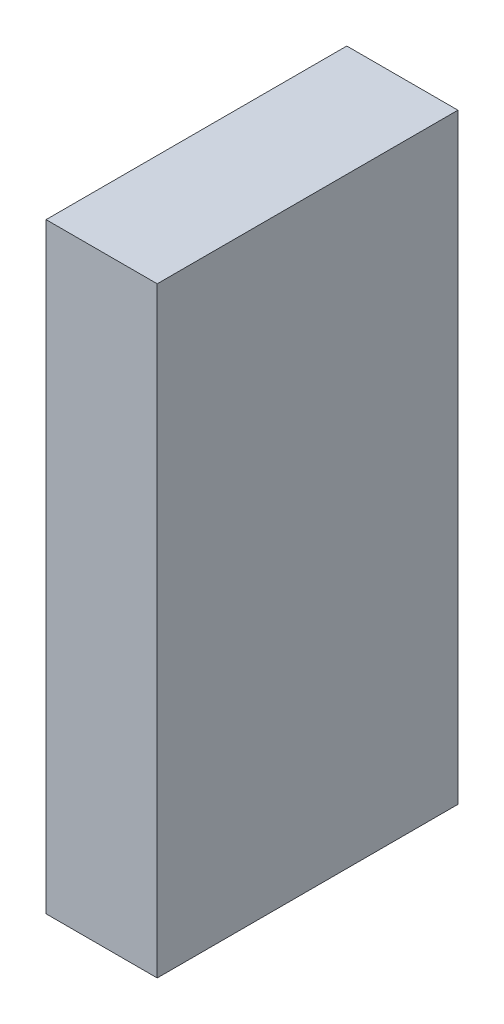
ISO-10303-21;
HEADER;
FILE_DESCRIPTION(('STEP AP214'),'2;1');
FILE_NAME('part.step','',(''),(''),'','','');
FILE_SCHEMA(('AUTOMOTIVE_DESIGN { 1 0 10303 214 1 1 1 1 }'));
ENDSEC;
DATA;
#1=APPLICATION_CONTEXT('core data for automotive mechanical design processes');
#2=APPLICATION_PROTOCOL_DEFINITION('international standard','automotive_design',2000,#1);
#3=PRODUCT_CONTEXT('',#1,'mechanical');
#4=PRODUCT('Part','Part','',(#3));
#5=PRODUCT_RELATED_PRODUCT_CATEGORY('part','',(#4));
#6=PRODUCT_DEFINITION_FORMATION('','',#4);
#7=PRODUCT_DEFINITION_CONTEXT('part definition',#1,'design');
#8=PRODUCT_DEFINITION('design','',#6,#7);
#9=PRODUCT_DEFINITION_SHAPE('','',#8);
#10=(LENGTH_UNIT() NAMED_UNIT(*) SI_UNIT(.MILLI.,.METRE.));
#11=(NAMED_UNIT(*) PLANE_ANGLE_UNIT() SI_UNIT($,.RADIAN.));
#12=(NAMED_UNIT(*) SI_UNIT($,.STERADIAN.) SOLID_ANGLE_UNIT());
#13=UNCERTAINTY_MEASURE_WITH_UNIT(LENGTH_MEASURE(1.E-05),#10,'distance_accuracy_value','');
#14=(GEOMETRIC_REPRESENTATION_CONTEXT(3) GLOBAL_UNCERTAINTY_ASSIGNED_CONTEXT((#13)) GLOBAL_UNIT_ASSIGNED_CONTEXT((#10,
#11,#12)) REPRESENTATION_CONTEXT('',''));
#15=CARTESIAN_POINT('',(0.,0.,0.));
#16=DIRECTION('',(0.,0.,1.));
#17=DIRECTION('',(1.,0.,0.));
#18=AXIS2_PLACEMENT_3D('',#15,#16,#17);
#19=CARTESIAN_POINT('',(0.2494915,1.34949184,0.));
#20=DIRECTION('',(1.,0.,0.));
#21=DIRECTION('',(0.,0.,-1.));
#22=AXIS2_PLACEMENT_3D('',#19,#20,#21);
#23=PLANE('',#22);
#24=DIRECTION('',(0.,0.,-1.));
#25=VECTOR('',#24,1.);
#26=CARTESIAN_POINT('',(0.2494915,-1.34949184,0.));
#27=LINE('',#26,#25);
#28=CARTESIAN_POINT('',(0.2494915,-1.34949184,0.));
#29=VERTEX_POINT('',#28);
#30=CARTESIAN_POINT('',(0.2494915,-1.34949184,1.34999984));
#31=VERTEX_POINT('',#30);
#32=EDGE_CURVE('E20',#29,#31,#27,.F.);
#33=ORIENTED_EDGE('',*,*,#32,.F.);
#34=DIRECTION('',(0.,1.,0.));
#35=VECTOR('',#34,1.);
#36=CARTESIAN_POINT('',(0.2494915,0.,0.));
#37=LINE('',#36,#35);
#38=CARTESIAN_POINT('',(0.2494915,1.34949184,0.));
#39=VERTEX_POINT('',#38);
#40=EDGE_CURVE('E80',#39,#29,#37,.F.);
#41=ORIENTED_EDGE('',*,*,#40,.F.);
#42=DIRECTION('',(0.,0.,1.));
#43=VECTOR('',#42,1.);
#44=CARTESIAN_POINT('',(0.2494915,1.34949184,0.));
#45=LINE('',#44,#43);
#46=CARTESIAN_POINT('',(0.2494915,1.34949184,1.34999984));
#47=VERTEX_POINT('',#46);
#48=EDGE_CURVE('E61',#47,#39,#45,.F.);
#49=ORIENTED_EDGE('',*,*,#48,.F.);
#50=DIRECTION('',(0.,1.,0.));
#51=VECTOR('',#50,1.);
#52=CARTESIAN_POINT('',(0.2494915,0.,1.34999984));
#53=LINE('',#52,#51);
#54=EDGE_CURVE('E55',#47,#31,#53,.F.);
#55=ORIENTED_EDGE('',*,*,#54,.T.);
#56=EDGE_LOOP('',(#33,#41,#49,#55));
#57=FACE_BOUND('',#56,.T.);
#58=ADVANCED_FACE('F17',(#57),#23,.T.);
#59=CARTESIAN_POINT('',(0.2494915,-1.34949184,0.));
#60=DIRECTION('',(0.,-1.,0.));
#61=DIRECTION('',(0.,0.,-1.));
#62=AXIS2_PLACEMENT_3D('',#59,#60,#61);
#63=PLANE('',#62);
#64=DIRECTION('',(0.,0.,1.));
#65=VECTOR('',#64,1.);
#66=CARTESIAN_POINT('',(-0.2494915,-1.34949184,0.));
#67=LINE('',#66,#65);
#68=CARTESIAN_POINT('',(-0.2494915,-1.34949184,0.));
#69=VERTEX_POINT('',#68);
#70=CARTESIAN_POINT('',(-0.2494915,-1.34949184,1.34999984));
#71=VERTEX_POINT('',#70);
#72=EDGE_CURVE('E83',#69,#71,#67,.T.);
#73=ORIENTED_EDGE('',*,*,#72,.F.);
#74=DIRECTION('',(-1.,0.,0.));
#75=VECTOR('',#74,1.);
#76=CARTESIAN_POINT('',(0.,-1.34949184,0.));
#77=LINE('',#76,#75);
#78=EDGE_CURVE('E68',#29,#69,#77,.T.);
#79=ORIENTED_EDGE('',*,*,#78,.F.);
#80=ORIENTED_EDGE('',*,*,#32,.T.);
#81=DIRECTION('',(-1.,0.,0.));
#82=VECTOR('',#81,1.);
#83=CARTESIAN_POINT('',(0.,-1.34949184,1.34999984));
#84=LINE('',#83,#82);
#85=EDGE_CURVE('E63',#31,#71,#84,.T.);
#86=ORIENTED_EDGE('',*,*,#85,.T.);
#87=EDGE_LOOP('',(#73,#79,#80,#86));
#88=FACE_BOUND('',#87,.T.);
#89=ADVANCED_FACE('F65',(#88),#63,.T.);
#90=CARTESIAN_POINT('',(0.,0.,1.34999984));
#91=DIRECTION('',(0.,0.,-1.));
#92=DIRECTION('',(-1.,0.,0.));
#93=AXIS2_PLACEMENT_3D('',#90,#91,#92);
#94=PLANE('',#93);
#95=ORIENTED_EDGE('',*,*,#54,.F.);
#96=DIRECTION('',(1.,0.,0.));
#97=VECTOR('',#96,1.);
#98=CARTESIAN_POINT('',(-0.2494915,1.34949184,1.34999984));
#99=LINE('',#98,#97);
#100=CARTESIAN_POINT('',(-0.2494915,1.34949184,1.34999984));
#101=VERTEX_POINT('',#100);
#102=EDGE_CURVE('E74',#101,#47,#99,.T.);
#103=ORIENTED_EDGE('',*,*,#102,.F.);
#104=DIRECTION('',(0.,1.,0.));
#105=VECTOR('',#104,1.);
#106=CARTESIAN_POINT('',(-0.2494915,-1.34949184,1.34999984));
#107=LINE('',#106,#105);
#108=EDGE_CURVE('E72',#71,#101,#107,.T.);
#109=ORIENTED_EDGE('',*,*,#108,.F.);
#110=ORIENTED_EDGE('',*,*,#85,.F.);
#111=EDGE_LOOP('',(#95,#103,#109,#110));
#112=FACE_BOUND('',#111,.T.);
#113=ADVANCED_FACE('F70',(#112),#94,.F.);
#114=CARTESIAN_POINT('',(-0.2494915,1.34949184,0.));
#115=DIRECTION('',(0.,1.,0.));
#116=DIRECTION('',(0.,0.,1.));
#117=AXIS2_PLACEMENT_3D('',#114,#115,#116);
#118=PLANE('',#117);
#119=ORIENTED_EDGE('',*,*,#48,.T.);
#120=DIRECTION('',(-1.,0.,0.));
#121=VECTOR('',#120,1.);
#122=CARTESIAN_POINT('',(0.,1.34949184,0.));
#123=LINE('',#122,#121);
#124=CARTESIAN_POINT('',(-0.2494915,1.34949184,0.));
#125=VERTEX_POINT('',#124);
#126=EDGE_CURVE('E35',#125,#39,#123,.F.);
#127=ORIENTED_EDGE('',*,*,#126,.F.);
#128=DIRECTION('',(0.,0.,1.));
#129=VECTOR('',#128,1.);
#130=CARTESIAN_POINT('',(-0.2494915,1.34949184,0.));
#131=LINE('',#130,#129);
#132=EDGE_CURVE('E26',#101,#125,#131,.F.);
#133=ORIENTED_EDGE('',*,*,#132,.F.);
#134=ORIENTED_EDGE('',*,*,#102,.T.);
#135=EDGE_LOOP('',(#119,#127,#133,#134));
#136=FACE_BOUND('',#135,.T.);
#137=ADVANCED_FACE('F89',(#136),#118,.T.);
#138=CARTESIAN_POINT('',(0.,0.,0.));
#139=DIRECTION('',(0.,0.,-1.));
#140=DIRECTION('',(-1.,0.,0.));
#141=AXIS2_PLACEMENT_3D('',#138,#139,#140);
#142=PLANE('',#141);
#143=ORIENTED_EDGE('',*,*,#40,.T.);
#144=ORIENTED_EDGE('',*,*,#78,.T.);
#145=DIRECTION('',(0.,1.,0.));
#146=VECTOR('',#145,1.);
#147=CARTESIAN_POINT('',(-0.2494915,-1.34949184,0.));
#148=LINE('',#147,#146);
#149=EDGE_CURVE('E11',#125,#69,#148,.F.);
#150=ORIENTED_EDGE('',*,*,#149,.F.);
#151=ORIENTED_EDGE('',*,*,#126,.T.);
#152=EDGE_LOOP('',(#143,#144,#150,#151));
#153=FACE_BOUND('',#152,.T.);
#154=ADVANCED_FACE('F91',(#153),#142,.T.);
#155=CARTESIAN_POINT('',(-0.2494915,-1.34949184,0.));
#156=DIRECTION('',(-1.,0.,0.));
#157=DIRECTION('',(0.,0.,1.));
#158=AXIS2_PLACEMENT_3D('',#155,#156,#157);
#159=PLANE('',#158);
#160=ORIENTED_EDGE('',*,*,#132,.T.);
#161=ORIENTED_EDGE('',*,*,#149,.T.);
#162=ORIENTED_EDGE('',*,*,#72,.T.);
#163=ORIENTED_EDGE('',*,*,#108,.T.);
#164=EDGE_LOOP('',(#160,#161,#162,#163));
#165=FACE_BOUND('',#164,.T.);
#166=ADVANCED_FACE('F88',(#165),#159,.T.);
#167=CLOSED_SHELL('',(#58,#89,#113,#137,#154,#166));
#168=MANIFOLD_SOLID_BREP('B1',#167);
#169=ADVANCED_BREP_SHAPE_REPRESENTATION('',(#18,#168),#14);
#170=SHAPE_DEFINITION_REPRESENTATION(#9,#169);
ENDSEC;
END-ISO-10303-21;
